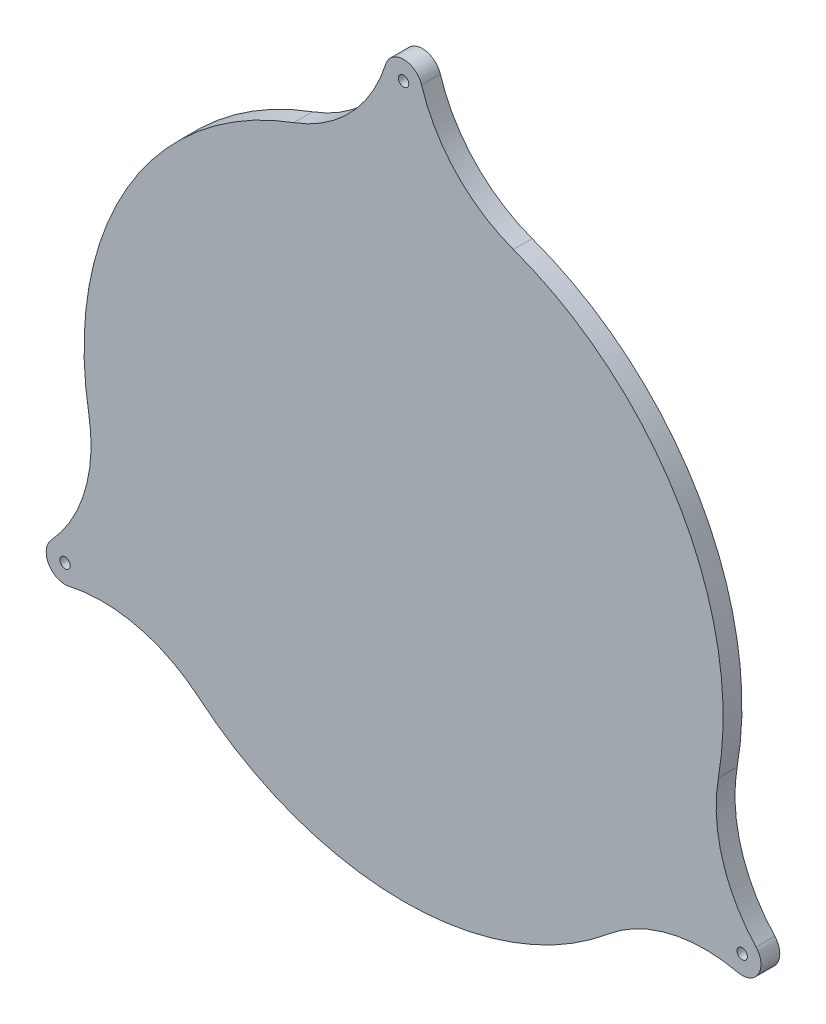
ISO-10303-21;
HEADER;
FILE_DESCRIPTION(('STEP AP214'),'2;1');
FILE_NAME('part.step','',(''),(''),'','','');
FILE_SCHEMA(('AUTOMOTIVE_DESIGN { 1 0 10303 214 1 1 1 1 }'));
ENDSEC;
DATA;
#1=APPLICATION_CONTEXT('core data for automotive mechanical design processes');
#2=APPLICATION_PROTOCOL_DEFINITION('international standard','automotive_design',2000,#1);
#3=PRODUCT_CONTEXT('',#1,'mechanical');
#4=PRODUCT('Part','Part','',(#3));
#5=PRODUCT_RELATED_PRODUCT_CATEGORY('part','',(#4));
#6=PRODUCT_DEFINITION_FORMATION('','',#4);
#7=PRODUCT_DEFINITION_CONTEXT('part definition',#1,'design');
#8=PRODUCT_DEFINITION('design','',#6,#7);
#9=PRODUCT_DEFINITION_SHAPE('','',#8);
#10=(LENGTH_UNIT() NAMED_UNIT(*) SI_UNIT(.MILLI.,.METRE.));
#11=(NAMED_UNIT(*) PLANE_ANGLE_UNIT() SI_UNIT($,.RADIAN.));
#12=(NAMED_UNIT(*) SI_UNIT($,.STERADIAN.) SOLID_ANGLE_UNIT());
#13=UNCERTAINTY_MEASURE_WITH_UNIT(LENGTH_MEASURE(1.E-05),#10,'distance_accuracy_value','');
#14=(GEOMETRIC_REPRESENTATION_CONTEXT(3) GLOBAL_UNCERTAINTY_ASSIGNED_CONTEXT((#13)) GLOBAL_UNIT_ASSIGNED_CONTEXT((#10,
#11,#12)) REPRESENTATION_CONTEXT('',''));
#15=CARTESIAN_POINT('',(0.,0.,0.));
#16=DIRECTION('',(0.,0.,1.));
#17=DIRECTION('',(1.,0.,0.));
#18=AXIS2_PLACEMENT_3D('',#15,#16,#17);
#19=CARTESIAN_POINT('',(21.4816902908379,58.6923076923077,5.));
#20=DIRECTION('',(0.,0.,1.));
#21=DIRECTION('',(1.,0.,0.));
#22=AXIS2_PLACEMENT_3D('',#19,#20,#21);
#23=PLANE('',#22);
#24=CARTESIAN_POINT('',(90.0666419935817,-52.,5.));
#25=DIRECTION('',(0.,0.,1.));
#26=DIRECTION('',(1.,0.,0.));
#27=AXIS2_PLACEMENT_3D('',#24,#25,#26);
#28=CIRCLE('',#27,1.375);
#29=CARTESIAN_POINT('',(91.4416419935817,-52.,5.));
#30=VERTEX_POINT('',#29);
#31=EDGE_CURVE('E290',#30,#30,#28,.T.);
#32=ORIENTED_EDGE('',*,*,#31,.F.);
#33=EDGE_LOOP('',(#32));
#34=FACE_BOUND('',#33,.T.);
#35=CARTESIAN_POINT('',(42.9633805816758,117.384615384615,5.));
#36=DIRECTION('',(0.,0.,-1.));
#37=DIRECTION('',(1.,0.,0.));
#38=AXIS2_PLACEMENT_3D('',#35,#36,#37);
#39=CIRCLE('',#38,40.);
#40=CARTESIAN_POINT('',(29.2150987955395,79.8215384615384,5.));
#41=VERTEX_POINT('',#40);
#42=CARTESIAN_POINT('',(4.77370895351953,105.487179487179,5.));
#43=VERTEX_POINT('',#42);
#44=EDGE_CURVE('E181',#41,#43,#39,.T.);
#45=ORIENTED_EDGE('',*,*,#44,.T.);
#46=CARTESIAN_POINT('',(0.,104.,5.));
#47=DIRECTION('',(0.,0.,1.));
#48=DIRECTION('',(1.,0.,0.));
#49=AXIS2_PLACEMENT_3D('',#46,#47,#48);
#50=CIRCLE('',#49,5.);
#51=CARTESIAN_POINT('',(-4.77370895351953,105.487179487179,5.));
#52=VERTEX_POINT('',#51);
#53=EDGE_CURVE('E109',#43,#52,#50,.T.);
#54=ORIENTED_EDGE('',*,*,#53,.T.);
#55=CARTESIAN_POINT('',(-42.9633805816758,117.384615384615,5.));
#56=DIRECTION('',(0.,0.,-1.));
#57=DIRECTION('',(-1.,0.,0.));
#58=AXIS2_PLACEMENT_3D('',#55,#56,#57);
#59=CIRCLE('',#58,40.);
#60=CARTESIAN_POINT('',(-29.2150987955395,79.8215384615385,5.));
#61=VERTEX_POINT('',#60);
#62=EDGE_CURVE('E208',#52,#61,#59,.T.);
#63=ORIENTED_EDGE('',*,*,#62,.T.);
#64=CARTESIAN_POINT('',(0.,0.,5.));
#65=DIRECTION('',(0.,0.,1.));
#66=DIRECTION('',(1.,0.,0.));
#67=AXIS2_PLACEMENT_3D('',#64,#65,#66);
#68=CIRCLE('',#67,85.);
#69=CARTESIAN_POINT('',(-83.7350294746187,-14.6097514997598,5.));
#70=VERTEX_POINT('',#69);
#71=EDGE_CURVE('E227',#61,#70,#68,.T.);
#72=ORIENTED_EDGE('',*,*,#71,.T.);
#73=CARTESIAN_POINT('',(-123.13974922738,-21.4849286761175,5.));
#74=DIRECTION('',(0.,0.,-1.));
#75=DIRECTION('',(1.,0.,0.));
#76=AXIS2_PLACEMENT_3D('',#73,#74,#75);
#77=CIRCLE('',#76,40.);
#78=CARTESIAN_POINT('',(-93.7414316862259,-48.6094365195686,5.));
#79=VERTEX_POINT('',#78);
#80=EDGE_CURVE('E224',#70,#79,#77,.T.);
#81=ORIENTED_EDGE('',*,*,#80,.T.);
#82=CARTESIAN_POINT('',(-90.0666419935816,-52.,5.));
#83=DIRECTION('',(0.,0.,1.));
#84=DIRECTION('',(1.,0.,0.));
#85=AXIS2_PLACEMENT_3D('',#82,#83,#84);
#86=CIRCLE('',#85,4.99999999999999);
#87=CARTESIAN_POINT('',(-88.9677227327064,-56.8777429676109,5.));
#88=VERTEX_POINT('',#87);
#89=EDGE_CURVE('E226',#79,#88,#86,.T.);
#90=ORIENTED_EDGE('',*,*,#89,.T.);
#91=CARTESIAN_POINT('',(-80.1763686457046,-95.899686708498,5.));
#92=DIRECTION('',(0.,0.,-1.));
#93=DIRECTION('',(-1.,0.,0.));
#94=AXIS2_PLACEMENT_3D('',#91,#92,#93);
#95=CIRCLE('',#94,40.);
#96=CARTESIAN_POINT('',(-54.5199306790791,-65.2117869617787,5.));
#97=VERTEX_POINT('',#96);
#98=EDGE_CURVE('E229',#88,#97,#95,.T.);
#99=ORIENTED_EDGE('',*,*,#98,.T.);
#100=CARTESIAN_POINT('',(0.,0.,5.));
#101=DIRECTION('',(0.,0.,1.));
#102=DIRECTION('',(1.,0.,0.));
#103=AXIS2_PLACEMENT_3D('',#100,#101,#102);
#104=CIRCLE('',#103,85.);
#105=CARTESIAN_POINT('',(54.5199306790791,-65.2117869617787,5.));
#106=VERTEX_POINT('',#105);
#107=EDGE_CURVE('E235',#97,#106,#104,.T.);
#108=ORIENTED_EDGE('',*,*,#107,.T.);
#109=CARTESIAN_POINT('',(80.1763686457047,-95.899686708498,5.));
#110=DIRECTION('',(0.,0.,-1.));
#111=DIRECTION('',(1.,0.,0.));
#112=AXIS2_PLACEMENT_3D('',#109,#110,#111);
#113=CIRCLE('',#112,40.);
#114=CARTESIAN_POINT('',(88.9677227327064,-56.8777429676109,5.));
#115=VERTEX_POINT('',#114);
#116=EDGE_CURVE('E140',#106,#115,#113,.T.);
#117=ORIENTED_EDGE('',*,*,#116,.T.);
#118=CARTESIAN_POINT('',(90.0666419935817,-52.,5.));
#119=DIRECTION('',(0.,0.,1.));
#120=DIRECTION('',(1.,0.,0.));
#121=AXIS2_PLACEMENT_3D('',#118,#119,#120);
#122=CIRCLE('',#121,4.99999999999998);
#123=CARTESIAN_POINT('',(93.7414316862259,-48.6094365195686,5.));
#124=VERTEX_POINT('',#123);
#125=EDGE_CURVE('E134',#115,#124,#122,.T.);
#126=ORIENTED_EDGE('',*,*,#125,.T.);
#127=CARTESIAN_POINT('',(123.13974922738,-21.4849286761174,5.));
#128=DIRECTION('',(0.,0.,-1.));
#129=DIRECTION('',(-1.,0.,0.));
#130=AXIS2_PLACEMENT_3D('',#127,#128,#129);
#131=CIRCLE('',#130,40.);
#132=CARTESIAN_POINT('',(83.7350294746187,-14.6097514997598,5.));
#133=VERTEX_POINT('',#132);
#134=EDGE_CURVE('E138',#124,#133,#131,.T.);
#135=ORIENTED_EDGE('',*,*,#134,.T.);
#136=CARTESIAN_POINT('',(0.,0.,5.));
#137=DIRECTION('',(0.,0.,1.));
#138=DIRECTION('',(1.,0.,0.));
#139=AXIS2_PLACEMENT_3D('',#136,#137,#138);
#140=CIRCLE('',#139,85.);
#141=EDGE_CURVE('E54',#133,#41,#140,.T.);
#142=ORIENTED_EDGE('',*,*,#141,.T.);
#143=EDGE_LOOP('',(#45,#54,#63,#72,#81,#90,#99,#108,#117,#126,#135,#142));
#144=FACE_BOUND('',#143,.T.);
#145=CARTESIAN_POINT('',(0.,104.,5.));
#146=DIRECTION('',(0.,0.,1.));
#147=DIRECTION('',(1.,0.,0.));
#148=AXIS2_PLACEMENT_3D('',#145,#146,#147);
#149=CIRCLE('',#148,1.375);
#150=CARTESIAN_POINT('',(1.375,104.,5.));
#151=VERTEX_POINT('',#150);
#152=EDGE_CURVE('E162',#151,#151,#149,.T.);
#153=ORIENTED_EDGE('',*,*,#152,.F.);
#154=EDGE_LOOP('',(#153));
#155=FACE_BOUND('',#154,.T.);
#156=CARTESIAN_POINT('',(-90.0666419935816,-52.,5.));
#157=DIRECTION('',(0.,0.,1.));
#158=DIRECTION('',(1.,0.,0.));
#159=AXIS2_PLACEMENT_3D('',#156,#157,#158);
#160=CIRCLE('',#159,1.375);
#161=CARTESIAN_POINT('',(-88.6916419935816,-52.,5.));
#162=VERTEX_POINT('',#161);
#163=EDGE_CURVE('E281',#162,#162,#160,.T.);
#164=ORIENTED_EDGE('',*,*,#163,.F.);
#165=EDGE_LOOP('',(#164));
#166=FACE_BOUND('',#165,.T.);
#167=ADVANCED_FACE('F37',(#34,#144,#155,#166),#23,.T.);
#168=CARTESIAN_POINT('',(21.4816902908379,58.6923076923077,0.));
#169=DIRECTION('',(0.,0.,1.));
#170=DIRECTION('',(1.,0.,0.));
#171=AXIS2_PLACEMENT_3D('',#168,#169,#170);
#172=PLANE('',#171);
#173=CARTESIAN_POINT('',(42.9633805816758,117.384615384615,0.));
#174=DIRECTION('',(0.,0.,-1.));
#175=DIRECTION('',(1.,0.,0.));
#176=AXIS2_PLACEMENT_3D('',#173,#174,#175);
#177=CIRCLE('',#176,40.);
#178=CARTESIAN_POINT('',(29.2150987955395,79.8215384615384,0.));
#179=VERTEX_POINT('',#178);
#180=CARTESIAN_POINT('',(4.77370895351953,105.487179487179,0.));
#181=VERTEX_POINT('',#180);
#182=EDGE_CURVE('E158',#179,#181,#177,.T.);
#183=ORIENTED_EDGE('',*,*,#182,.F.);
#184=CARTESIAN_POINT('',(0.,0.,0.));
#185=DIRECTION('',(0.,0.,1.));
#186=DIRECTION('',(1.,0.,0.));
#187=AXIS2_PLACEMENT_3D('',#184,#185,#186);
#188=CIRCLE('',#187,85.);
#189=CARTESIAN_POINT('',(83.7350294746187,-14.6097514997598,0.));
#190=VERTEX_POINT('',#189);
#191=EDGE_CURVE('E101',#190,#179,#188,.T.);
#192=ORIENTED_EDGE('',*,*,#191,.F.);
#193=CARTESIAN_POINT('',(123.13974922738,-21.4849286761174,0.));
#194=DIRECTION('',(0.,0.,-1.));
#195=DIRECTION('',(-1.,0.,0.));
#196=AXIS2_PLACEMENT_3D('',#193,#194,#195);
#197=CIRCLE('',#196,40.);
#198=CARTESIAN_POINT('',(93.7414316862259,-48.6094365195686,0.));
#199=VERTEX_POINT('',#198);
#200=EDGE_CURVE('E95',#199,#190,#197,.T.);
#201=ORIENTED_EDGE('',*,*,#200,.F.);
#202=CARTESIAN_POINT('',(90.0666419935817,-52.,0.));
#203=DIRECTION('',(0.,0.,1.));
#204=DIRECTION('',(1.,0.,0.));
#205=AXIS2_PLACEMENT_3D('',#202,#203,#204);
#206=CIRCLE('',#205,4.99999999999998);
#207=CARTESIAN_POINT('',(88.9677227327064,-56.8777429676109,0.));
#208=VERTEX_POINT('',#207);
#209=EDGE_CURVE('E148',#208,#199,#206,.T.);
#210=ORIENTED_EDGE('',*,*,#209,.F.);
#211=CARTESIAN_POINT('',(80.1763686457047,-95.899686708498,0.));
#212=DIRECTION('',(0.,0.,-1.));
#213=DIRECTION('',(1.,0.,0.));
#214=AXIS2_PLACEMENT_3D('',#211,#212,#213);
#215=CIRCLE('',#214,40.);
#216=CARTESIAN_POINT('',(54.5199306790791,-65.2117869617787,0.));
#217=VERTEX_POINT('',#216);
#218=EDGE_CURVE('E176',#217,#208,#215,.T.);
#219=ORIENTED_EDGE('',*,*,#218,.F.);
#220=CARTESIAN_POINT('',(0.,0.,0.));
#221=DIRECTION('',(0.,0.,1.));
#222=DIRECTION('',(1.,0.,0.));
#223=AXIS2_PLACEMENT_3D('',#220,#221,#222);
#224=CIRCLE('',#223,85.);
#225=CARTESIAN_POINT('',(-54.5199306790791,-65.2117869617787,0.));
#226=VERTEX_POINT('',#225);
#227=EDGE_CURVE('E174',#226,#217,#224,.T.);
#228=ORIENTED_EDGE('',*,*,#227,.F.);
#229=CARTESIAN_POINT('',(-80.1763686457046,-95.899686708498,0.));
#230=DIRECTION('',(0.,0.,-1.));
#231=DIRECTION('',(-1.,0.,0.));
#232=AXIS2_PLACEMENT_3D('',#229,#230,#231);
#233=CIRCLE('',#232,40.);
#234=CARTESIAN_POINT('',(-88.9677227327064,-56.8777429676109,0.));
#235=VERTEX_POINT('',#234);
#236=EDGE_CURVE('E172',#235,#226,#233,.T.);
#237=ORIENTED_EDGE('',*,*,#236,.F.);
#238=CARTESIAN_POINT('',(-90.0666419935816,-52.,0.));
#239=DIRECTION('',(0.,0.,1.));
#240=DIRECTION('',(1.,0.,0.));
#241=AXIS2_PLACEMENT_3D('',#238,#239,#240);
#242=CIRCLE('',#241,4.99999999999999);
#243=CARTESIAN_POINT('',(-93.7414316862259,-48.6094365195686,0.));
#244=VERTEX_POINT('',#243);
#245=EDGE_CURVE('E170',#244,#235,#242,.T.);
#246=ORIENTED_EDGE('',*,*,#245,.F.);
#247=CARTESIAN_POINT('',(-123.13974922738,-21.4849286761175,0.));
#248=DIRECTION('',(0.,0.,-1.));
#249=DIRECTION('',(1.,0.,0.));
#250=AXIS2_PLACEMENT_3D('',#247,#248,#249);
#251=CIRCLE('',#250,40.);
#252=CARTESIAN_POINT('',(-83.7350294746187,-14.6097514997598,0.));
#253=VERTEX_POINT('',#252);
#254=EDGE_CURVE('E168',#253,#244,#251,.T.);
#255=ORIENTED_EDGE('',*,*,#254,.F.);
#256=CARTESIAN_POINT('',(0.,0.,0.));
#257=DIRECTION('',(0.,0.,1.));
#258=DIRECTION('',(1.,0.,0.));
#259=AXIS2_PLACEMENT_3D('',#256,#257,#258);
#260=CIRCLE('',#259,85.);
#261=CARTESIAN_POINT('',(-29.2150987955395,79.8215384615385,0.));
#262=VERTEX_POINT('',#261);
#263=EDGE_CURVE('E166',#262,#253,#260,.T.);
#264=ORIENTED_EDGE('',*,*,#263,.F.);
#265=CARTESIAN_POINT('',(-42.9633805816758,117.384615384615,0.));
#266=DIRECTION('',(0.,0.,-1.));
#267=DIRECTION('',(-1.,0.,0.));
#268=AXIS2_PLACEMENT_3D('',#265,#266,#267);
#269=CIRCLE('',#268,40.);
#270=CARTESIAN_POINT('',(-4.77370895351953,105.487179487179,0.));
#271=VERTEX_POINT('',#270);
#272=EDGE_CURVE('E164',#271,#262,#269,.T.);
#273=ORIENTED_EDGE('',*,*,#272,.F.);
#274=CARTESIAN_POINT('',(0.,104.,0.));
#275=DIRECTION('',(0.,0.,1.));
#276=DIRECTION('',(1.,0.,0.));
#277=AXIS2_PLACEMENT_3D('',#274,#275,#276);
#278=CIRCLE('',#277,5.);
#279=EDGE_CURVE('E161',#181,#271,#278,.T.);
#280=ORIENTED_EDGE('',*,*,#279,.F.);
#281=EDGE_LOOP('',(#183,#192,#201,#210,#219,#228,#237,#246,#255,#264,#273,#280));
#282=FACE_BOUND('',#281,.T.);
#283=CARTESIAN_POINT('',(0.,104.,0.));
#284=DIRECTION('',(0.,0.,1.));
#285=DIRECTION('',(1.,0.,0.));
#286=AXIS2_PLACEMENT_3D('',#283,#284,#285);
#287=CIRCLE('',#286,1.375);
#288=CARTESIAN_POINT('',(1.375,104.,0.));
#289=VERTEX_POINT('',#288);
#290=EDGE_CURVE('E293',#289,#289,#287,.T.);
#291=ORIENTED_EDGE('',*,*,#290,.T.);
#292=EDGE_LOOP('',(#291));
#293=FACE_BOUND('',#292,.T.);
#294=CARTESIAN_POINT('',(90.0666419935817,-52.,0.));
#295=DIRECTION('',(0.,0.,1.));
#296=DIRECTION('',(1.,0.,0.));
#297=AXIS2_PLACEMENT_3D('',#294,#295,#296);
#298=CIRCLE('',#297,1.375);
#299=CARTESIAN_POINT('',(91.4416419935817,-52.,0.));
#300=VERTEX_POINT('',#299);
#301=EDGE_CURVE('E287',#300,#300,#298,.T.);
#302=ORIENTED_EDGE('',*,*,#301,.T.);
#303=EDGE_LOOP('',(#302));
#304=FACE_BOUND('',#303,.T.);
#305=CARTESIAN_POINT('',(-90.0666419935816,-52.,0.));
#306=DIRECTION('',(0.,0.,1.));
#307=DIRECTION('',(1.,0.,0.));
#308=AXIS2_PLACEMENT_3D('',#305,#306,#307);
#309=CIRCLE('',#308,1.375);
#310=CARTESIAN_POINT('',(-88.6916419935816,-52.,0.));
#311=VERTEX_POINT('',#310);
#312=EDGE_CURVE('E284',#311,#311,#309,.T.);
#313=ORIENTED_EDGE('',*,*,#312,.T.);
#314=EDGE_LOOP('',(#313));
#315=FACE_BOUND('',#314,.T.);
#316=ADVANCED_FACE('F212',(#282,#293,#304,#315),#172,.F.);
#317=CARTESIAN_POINT('',(42.9633805816758,117.384615384615,5.));
#318=DIRECTION('',(0.,0.,-1.));
#319=DIRECTION('',(-1.,0.,0.));
#320=AXIS2_PLACEMENT_3D('',#317,#318,#319);
#321=CYLINDRICAL_SURFACE('',#320,40.);
#322=ORIENTED_EDGE('',*,*,#182,.T.);
#323=DIRECTION('',(0.,0.,-1.));
#324=VECTOR('',#323,1.);
#325=CARTESIAN_POINT('',(4.77370895351953,105.487179487179,5.));
#326=LINE('',#325,#324);
#327=EDGE_CURVE('E11',#43,#181,#326,.T.);
#328=ORIENTED_EDGE('',*,*,#327,.F.);
#329=ORIENTED_EDGE('',*,*,#44,.F.);
#330=DIRECTION('',(0.,0.,-1.));
#331=VECTOR('',#330,1.);
#332=CARTESIAN_POINT('',(29.2150987955395,79.8215384615384,5.));
#333=LINE('',#332,#331);
#334=EDGE_CURVE('E154',#41,#179,#333,.T.);
#335=ORIENTED_EDGE('',*,*,#334,.T.);
#336=EDGE_LOOP('',(#322,#328,#329,#335));
#337=FACE_BOUND('',#336,.T.);
#338=ADVANCED_FACE('F39',(#337),#321,.F.);
#339=CARTESIAN_POINT('',(0.,104.,5.));
#340=DIRECTION('',(0.,0.,-1.));
#341=DIRECTION('',(-1.,0.,0.));
#342=AXIS2_PLACEMENT_3D('',#339,#340,#341);
#343=CYLINDRICAL_SURFACE('',#342,5.);
#344=ORIENTED_EDGE('',*,*,#279,.T.);
#345=DIRECTION('',(0.,0.,-1.));
#346=VECTOR('',#345,1.);
#347=CARTESIAN_POINT('',(-4.77370895351953,105.487179487179,5.));
#348=LINE('',#347,#346);
#349=EDGE_CURVE('E46',#52,#271,#348,.T.);
#350=ORIENTED_EDGE('',*,*,#349,.F.);
#351=ORIENTED_EDGE('',*,*,#53,.F.);
#352=ORIENTED_EDGE('',*,*,#327,.T.);
#353=EDGE_LOOP('',(#344,#350,#351,#352));
#354=FACE_BOUND('',#353,.T.);
#355=ADVANCED_FACE('F395',(#354),#343,.T.);
#356=CARTESIAN_POINT('',(-42.9633805816758,117.384615384615,5.));
#357=DIRECTION('',(0.,0.,-1.));
#358=DIRECTION('',(-1.,0.,0.));
#359=AXIS2_PLACEMENT_3D('',#356,#357,#358);
#360=CYLINDRICAL_SURFACE('',#359,40.);
#361=ORIENTED_EDGE('',*,*,#272,.T.);
#362=DIRECTION('',(0.,0.,-1.));
#363=VECTOR('',#362,1.);
#364=CARTESIAN_POINT('',(-29.2150987955395,79.8215384615385,5.));
#365=LINE('',#364,#363);
#366=EDGE_CURVE('E200',#61,#262,#365,.T.);
#367=ORIENTED_EDGE('',*,*,#366,.F.);
#368=ORIENTED_EDGE('',*,*,#62,.F.);
#369=ORIENTED_EDGE('',*,*,#349,.T.);
#370=EDGE_LOOP('',(#361,#367,#368,#369));
#371=FACE_BOUND('',#370,.T.);
#372=ADVANCED_FACE('F206',(#371),#360,.F.);
#373=CARTESIAN_POINT('',(0.,0.,5.));
#374=DIRECTION('',(0.,0.,-1.));
#375=DIRECTION('',(-1.,0.,0.));
#376=AXIS2_PLACEMENT_3D('',#373,#374,#375);
#377=CYLINDRICAL_SURFACE('',#376,85.);
#378=ORIENTED_EDGE('',*,*,#263,.T.);
#379=DIRECTION('',(0.,0.,-1.));
#380=VECTOR('',#379,1.);
#381=CARTESIAN_POINT('',(-83.7350294746187,-14.6097514997598,5.));
#382=LINE('',#381,#380);
#383=EDGE_CURVE('E197',#70,#253,#382,.T.);
#384=ORIENTED_EDGE('',*,*,#383,.F.);
#385=ORIENTED_EDGE('',*,*,#71,.F.);
#386=ORIENTED_EDGE('',*,*,#366,.T.);
#387=EDGE_LOOP('',(#378,#384,#385,#386));
#388=FACE_BOUND('',#387,.T.);
#389=ADVANCED_FACE('F218',(#388),#377,.T.);
#390=CARTESIAN_POINT('',(-123.13974922738,-21.4849286761175,5.));
#391=DIRECTION('',(0.,0.,-1.));
#392=DIRECTION('',(-1.,0.,0.));
#393=AXIS2_PLACEMENT_3D('',#390,#391,#392);
#394=CYLINDRICAL_SURFACE('',#393,40.);
#395=ORIENTED_EDGE('',*,*,#254,.T.);
#396=DIRECTION('',(0.,0.,-1.));
#397=VECTOR('',#396,1.);
#398=CARTESIAN_POINT('',(-93.7414316862259,-48.6094365195686,5.));
#399=LINE('',#398,#397);
#400=EDGE_CURVE('E194',#79,#244,#399,.T.);
#401=ORIENTED_EDGE('',*,*,#400,.F.);
#402=ORIENTED_EDGE('',*,*,#80,.F.);
#403=ORIENTED_EDGE('',*,*,#383,.T.);
#404=EDGE_LOOP('',(#395,#401,#402,#403));
#405=FACE_BOUND('',#404,.T.);
#406=ADVANCED_FACE('F222',(#405),#394,.F.);
#407=CARTESIAN_POINT('',(-90.0666419935816,-52.,5.));
#408=DIRECTION('',(0.,0.,-1.));
#409=DIRECTION('',(-1.,0.,0.));
#410=AXIS2_PLACEMENT_3D('',#407,#408,#409);
#411=CYLINDRICAL_SURFACE('',#410,4.99999999999999);
#412=ORIENTED_EDGE('',*,*,#245,.T.);
#413=DIRECTION('',(0.,0.,-1.));
#414=VECTOR('',#413,1.);
#415=CARTESIAN_POINT('',(-88.9677227327064,-56.8777429676109,5.));
#416=LINE('',#415,#414);
#417=EDGE_CURVE('E191',#88,#235,#416,.T.);
#418=ORIENTED_EDGE('',*,*,#417,.F.);
#419=ORIENTED_EDGE('',*,*,#89,.F.);
#420=ORIENTED_EDGE('',*,*,#400,.T.);
#421=EDGE_LOOP('',(#412,#418,#419,#420));
#422=FACE_BOUND('',#421,.T.);
#423=ADVANCED_FACE('F360',(#422),#411,.T.);
#424=CARTESIAN_POINT('',(-80.1763686457046,-95.899686708498,5.));
#425=DIRECTION('',(0.,0.,-1.));
#426=DIRECTION('',(-1.,0.,0.));
#427=AXIS2_PLACEMENT_3D('',#424,#425,#426);
#428=CYLINDRICAL_SURFACE('',#427,40.);
#429=ORIENTED_EDGE('',*,*,#236,.T.);
#430=DIRECTION('',(0.,0.,-1.));
#431=VECTOR('',#430,1.);
#432=CARTESIAN_POINT('',(-54.5199306790791,-65.2117869617787,5.));
#433=LINE('',#432,#431);
#434=EDGE_CURVE('E188',#97,#226,#433,.T.);
#435=ORIENTED_EDGE('',*,*,#434,.F.);
#436=ORIENTED_EDGE('',*,*,#98,.F.);
#437=ORIENTED_EDGE('',*,*,#417,.T.);
#438=EDGE_LOOP('',(#429,#435,#436,#437));
#439=FACE_BOUND('',#438,.T.);
#440=ADVANCED_FACE('F351',(#439),#428,.F.);
#441=CARTESIAN_POINT('',(0.,0.,5.));
#442=DIRECTION('',(0.,0.,-1.));
#443=DIRECTION('',(-1.,0.,0.));
#444=AXIS2_PLACEMENT_3D('',#441,#442,#443);
#445=CYLINDRICAL_SURFACE('',#444,85.);
#446=ORIENTED_EDGE('',*,*,#227,.T.);
#447=DIRECTION('',(0.,0.,-1.));
#448=VECTOR('',#447,1.);
#449=CARTESIAN_POINT('',(54.5199306790791,-65.2117869617787,5.));
#450=LINE('',#449,#448);
#451=EDGE_CURVE('E185',#106,#217,#450,.T.);
#452=ORIENTED_EDGE('',*,*,#451,.F.);
#453=ORIENTED_EDGE('',*,*,#107,.F.);
#454=ORIENTED_EDGE('',*,*,#434,.T.);
#455=EDGE_LOOP('',(#446,#452,#453,#454));
#456=FACE_BOUND('',#455,.T.);
#457=ADVANCED_FACE('F241',(#456),#445,.T.);
#458=CARTESIAN_POINT('',(80.1763686457047,-95.899686708498,5.));
#459=DIRECTION('',(0.,0.,-1.));
#460=DIRECTION('',(-1.,0.,0.));
#461=AXIS2_PLACEMENT_3D('',#458,#459,#460);
#462=CYLINDRICAL_SURFACE('',#461,40.);
#463=ORIENTED_EDGE('',*,*,#218,.T.);
#464=DIRECTION('',(0.,0.,-1.));
#465=VECTOR('',#464,1.);
#466=CARTESIAN_POINT('',(88.9677227327064,-56.8777429676109,5.));
#467=LINE('',#466,#465);
#468=EDGE_CURVE('E149',#115,#208,#467,.T.);
#469=ORIENTED_EDGE('',*,*,#468,.F.);
#470=ORIENTED_EDGE('',*,*,#116,.F.);
#471=ORIENTED_EDGE('',*,*,#451,.T.);
#472=EDGE_LOOP('',(#463,#469,#470,#471));
#473=FACE_BOUND('',#472,.T.);
#474=ADVANCED_FACE('F245',(#473),#462,.F.);
#475=CARTESIAN_POINT('',(90.0666419935817,-52.,5.));
#476=DIRECTION('',(0.,0.,-1.));
#477=DIRECTION('',(-1.,0.,0.));
#478=AXIS2_PLACEMENT_3D('',#475,#476,#477);
#479=CYLINDRICAL_SURFACE('',#478,4.99999999999998);
#480=ORIENTED_EDGE('',*,*,#209,.T.);
#481=DIRECTION('',(0.,0.,-1.));
#482=VECTOR('',#481,1.);
#483=CARTESIAN_POINT('',(93.7414316862259,-48.6094365195686,5.));
#484=LINE('',#483,#482);
#485=EDGE_CURVE('E145',#124,#199,#484,.T.);
#486=ORIENTED_EDGE('',*,*,#485,.F.);
#487=ORIENTED_EDGE('',*,*,#125,.F.);
#488=ORIENTED_EDGE('',*,*,#468,.T.);
#489=EDGE_LOOP('',(#480,#486,#487,#488));
#490=FACE_BOUND('',#489,.T.);
#491=ADVANCED_FACE('F146',(#490),#479,.T.);
#492=CARTESIAN_POINT('',(123.13974922738,-21.4849286761174,5.));
#493=DIRECTION('',(0.,0.,-1.));
#494=DIRECTION('',(-1.,0.,0.));
#495=AXIS2_PLACEMENT_3D('',#492,#493,#494);
#496=CYLINDRICAL_SURFACE('',#495,40.);
#497=ORIENTED_EDGE('',*,*,#200,.T.);
#498=DIRECTION('',(0.,0.,-1.));
#499=VECTOR('',#498,1.);
#500=CARTESIAN_POINT('',(83.7350294746187,-14.6097514997598,5.));
#501=LINE('',#500,#499);
#502=EDGE_CURVE('E150',#133,#190,#501,.T.);
#503=ORIENTED_EDGE('',*,*,#502,.F.);
#504=ORIENTED_EDGE('',*,*,#134,.F.);
#505=ORIENTED_EDGE('',*,*,#485,.T.);
#506=EDGE_LOOP('',(#497,#503,#504,#505));
#507=FACE_BOUND('',#506,.T.);
#508=ADVANCED_FACE('F152',(#507),#496,.F.);
#509=CARTESIAN_POINT('',(0.,0.,5.));
#510=DIRECTION('',(0.,0.,-1.));
#511=DIRECTION('',(-1.,0.,0.));
#512=AXIS2_PLACEMENT_3D('',#509,#510,#511);
#513=CYLINDRICAL_SURFACE('',#512,85.);
#514=ORIENTED_EDGE('',*,*,#191,.T.);
#515=ORIENTED_EDGE('',*,*,#334,.F.);
#516=ORIENTED_EDGE('',*,*,#141,.F.);
#517=ORIENTED_EDGE('',*,*,#502,.T.);
#518=EDGE_LOOP('',(#514,#515,#516,#517));
#519=FACE_BOUND('',#518,.T.);
#520=ADVANCED_FACE('F249',(#519),#513,.T.);
#521=CARTESIAN_POINT('',(0.,104.,5.));
#522=DIRECTION('',(0.,0.,-1.));
#523=DIRECTION('',(-1.,0.,0.));
#524=AXIS2_PLACEMENT_3D('',#521,#522,#523);
#525=CYLINDRICAL_SURFACE('',#524,1.375);
#526=ORIENTED_EDGE('',*,*,#152,.T.);
#527=EDGE_LOOP('',(#526));
#528=FACE_BOUND('',#527,.T.);
#529=ORIENTED_EDGE('',*,*,#290,.F.);
#530=EDGE_LOOP('',(#529));
#531=FACE_BOUND('',#530,.T.);
#532=ADVANCED_FACE('F251',(#528,#531),#525,.F.);
#533=CARTESIAN_POINT('',(90.0666419935817,-52.,5.));
#534=DIRECTION('',(0.,0.,-1.));
#535=DIRECTION('',(-1.,0.,0.));
#536=AXIS2_PLACEMENT_3D('',#533,#534,#535);
#537=CYLINDRICAL_SURFACE('',#536,1.375);
#538=ORIENTED_EDGE('',*,*,#31,.T.);
#539=EDGE_LOOP('',(#538));
#540=FACE_BOUND('',#539,.T.);
#541=ORIENTED_EDGE('',*,*,#301,.F.);
#542=EDGE_LOOP('',(#541));
#543=FACE_BOUND('',#542,.T.);
#544=ADVANCED_FACE('F257',(#540,#543),#537,.F.);
#545=CARTESIAN_POINT('',(-90.0666419935816,-52.,5.));
#546=DIRECTION('',(0.,0.,-1.));
#547=DIRECTION('',(-1.,0.,0.));
#548=AXIS2_PLACEMENT_3D('',#545,#546,#547);
#549=CYLINDRICAL_SURFACE('',#548,1.375);
#550=ORIENTED_EDGE('',*,*,#163,.T.);
#551=EDGE_LOOP('',(#550));
#552=FACE_BOUND('',#551,.T.);
#553=ORIENTED_EDGE('',*,*,#312,.F.);
#554=EDGE_LOOP('',(#553));
#555=FACE_BOUND('',#554,.T.);
#556=ADVANCED_FACE('F272',(#552,#555),#549,.F.);
#557=CLOSED_SHELL('',(#167,#316,#338,#355,#372,#389,#406,#423,#440,#457,#474,#491,#508,#520,
#532,#544,#556));
#558=MANIFOLD_SOLID_BREP('B2',#557);
#559=ADVANCED_BREP_SHAPE_REPRESENTATION('',(#18,#558),#14);
#560=SHAPE_DEFINITION_REPRESENTATION(#9,#559);
ENDSEC;
END-ISO-10303-21;
